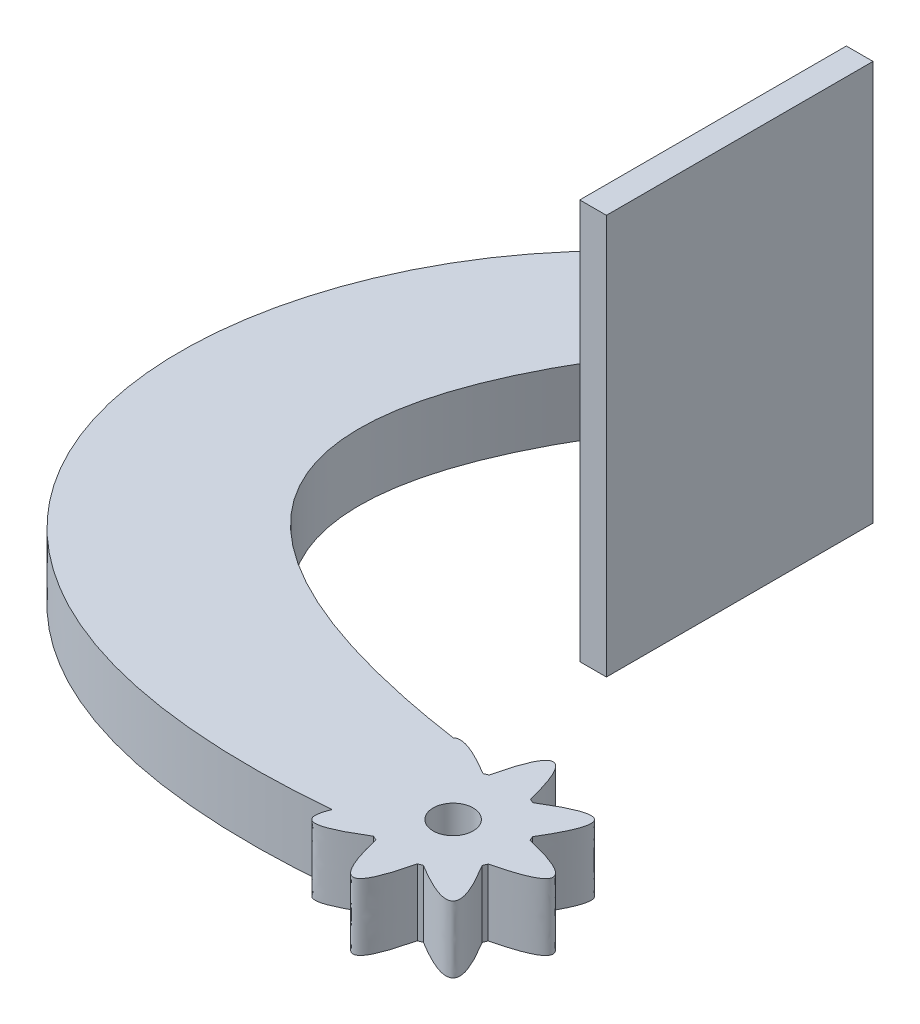
ISO-10303-21;
HEADER;
FILE_DESCRIPTION(('STEP AP214'),'2;1');
FILE_NAME('part.step','',(''),(''),'','','');
FILE_SCHEMA(('AUTOMOTIVE_DESIGN { 1 0 10303 214 1 1 1 1 }'));
ENDSEC;
DATA;
#1=APPLICATION_CONTEXT('core data for automotive mechanical design processes');
#2=APPLICATION_PROTOCOL_DEFINITION('international standard','automotive_design',2000,#1);
#3=PRODUCT_CONTEXT('',#1,'mechanical');
#4=PRODUCT('Part','Part','',(#3));
#5=PRODUCT_RELATED_PRODUCT_CATEGORY('part','',(#4));
#6=PRODUCT_DEFINITION_FORMATION('','',#4);
#7=PRODUCT_DEFINITION_CONTEXT('part definition',#1,'design');
#8=PRODUCT_DEFINITION('design','',#6,#7);
#9=PRODUCT_DEFINITION_SHAPE('','',#8);
#10=(LENGTH_UNIT() NAMED_UNIT(*) SI_UNIT(.MILLI.,.METRE.));
#11=(NAMED_UNIT(*) PLANE_ANGLE_UNIT() SI_UNIT($,.RADIAN.));
#12=(NAMED_UNIT(*) SI_UNIT($,.STERADIAN.) SOLID_ANGLE_UNIT());
#13=UNCERTAINTY_MEASURE_WITH_UNIT(LENGTH_MEASURE(1.E-05),#10,'distance_accuracy_value','');
#14=(GEOMETRIC_REPRESENTATION_CONTEXT(3) GLOBAL_UNCERTAINTY_ASSIGNED_CONTEXT((#13)) GLOBAL_UNIT_ASSIGNED_CONTEXT((#10,
#11,#12)) REPRESENTATION_CONTEXT('',''));
#15=CARTESIAN_POINT('',(0.,0.,0.));
#16=DIRECTION('',(0.,0.,1.));
#17=DIRECTION('',(1.,0.,0.));
#18=AXIS2_PLACEMENT_3D('',#15,#16,#17);
#19=CARTESIAN_POINT('',(-6.,2.5,42.5));
#20=DIRECTION('',(0.,-1.,0.));
#21=DIRECTION('',(0.,0.,-1.));
#22=AXIS2_PLACEMENT_3D('',#19,#20,#21);
#23=CYLINDRICAL_SURFACE('',#22,4.5);
#24=CARTESIAN_POINT('',(-6.,2.5,42.5));
#25=DIRECTION('',(0.,1.,0.));
#26=DIRECTION('',(0.,0.,1.));
#27=AXIS2_PLACEMENT_3D('',#24,#25,#26);
#28=CIRCLE('',#27,4.5);
#29=CARTESIAN_POINT('',(-7.90144374892193,2.5,46.5785428365638));
#30=VERTEX_POINT('',#29);
#31=CARTESIAN_POINT('',(-7.58091960966795,2.5,46.7131571520378));
#32=VERTEX_POINT('',#31);
#33=EDGE_CURVE('E43',#30,#32,#28,.T.);
#34=ORIENTED_EDGE('',*,*,#33,.F.);
#35=DIRECTION('',(0.,-1.,0.));
#36=VECTOR('',#35,1.);
#37=CARTESIAN_POINT('',(-7.90144374892191,2.5,46.5785428365638));
#38=LINE('',#37,#36);
#39=CARTESIAN_POINT('',(-7.90144374892191,-2.5,46.5785428365638));
#40=VERTEX_POINT('',#39);
#41=EDGE_CURVE('E261',#30,#40,#38,.T.);
#42=ORIENTED_EDGE('',*,*,#41,.T.);
#43=CARTESIAN_POINT('',(-6.,-2.5,42.5));
#44=DIRECTION('',(0.,1.,0.));
#45=DIRECTION('',(0.,0.,1.));
#46=AXIS2_PLACEMENT_3D('',#43,#44,#45);
#47=CIRCLE('',#46,4.5);
#48=CARTESIAN_POINT('',(-7.58091960966795,-2.5,46.7131571520378));
#49=VERTEX_POINT('',#48);
#50=EDGE_CURVE('E413',#40,#49,#47,.T.);
#51=ORIENTED_EDGE('',*,*,#50,.T.);
#52=DIRECTION('',(0.,-1.,0.));
#53=VECTOR('',#52,1.);
#54=CARTESIAN_POINT('',(-7.58091960966793,2.5,46.7131571520378));
#55=LINE('',#54,#53);
#56=EDGE_CURVE('E397',#32,#49,#55,.T.);
#57=ORIENTED_EDGE('',*,*,#56,.F.);
#58=EDGE_LOOP('',(#34,#42,#51,#57));
#59=FACE_BOUND('',#58,.T.);
#60=ADVANCED_FACE('F33',(#59),#23,.T.);
#61=CARTESIAN_POINT('',(-7.53944152818656,-2.5,38.2715109339985));
#62=VERTEX_POINT('',#61);
#63=CARTESIAN_POINT('',(-7.86127301590357,-2.5,38.4029690310825));
#64=VERTEX_POINT('',#63);
#65=EDGE_CURVE('E453',#62,#64,#47,.T.);
#66=ORIENTED_EDGE('',*,*,#65,.T.);
#67=DIRECTION('',(0.,-1.,0.));
#68=VECTOR('',#67,1.);
#69=CARTESIAN_POINT('',(-7.86127301590359,2.5,38.4029690310825));
#70=LINE('',#69,#68);
#71=CARTESIAN_POINT('',(-7.86127301590357,2.5,38.4029690310825));
#72=VERTEX_POINT('',#71);
#73=EDGE_CURVE('E281',#72,#64,#70,.T.);
#74=ORIENTED_EDGE('',*,*,#73,.F.);
#75=CARTESIAN_POINT('',(-7.53944152818656,2.5,38.2715109339985));
#76=VERTEX_POINT('',#75);
#77=EDGE_CURVE('E427',#76,#72,#28,.T.);
#78=ORIENTED_EDGE('',*,*,#77,.F.);
#79=DIRECTION('',(0.,-1.,0.));
#80=VECTOR('',#79,1.);
#81=CARTESIAN_POINT('',(-7.53944152818656,2.5,38.2715109339985));
#82=LINE('',#81,#80);
#83=EDGE_CURVE('E334',#76,#62,#82,.T.);
#84=ORIENTED_EDGE('',*,*,#83,.T.);
#85=EDGE_LOOP('',(#66,#74,#78,#84));
#86=FACE_BOUND('',#85,.T.);
#87=ADVANCED_FACE('F459',(#86),#23,.T.);
#88=CARTESIAN_POINT('',(-4.09855625107805,-2.5,38.4214571634362));
#89=VERTEX_POINT('',#88);
#90=CARTESIAN_POINT('',(-4.41908039033205,-2.5,38.2868428479622));
#91=VERTEX_POINT('',#90);
#92=EDGE_CURVE('E449',#89,#91,#47,.T.);
#93=ORIENTED_EDGE('',*,*,#92,.T.);
#94=DIRECTION('',(0.,-1.,0.));
#95=VECTOR('',#94,1.);
#96=CARTESIAN_POINT('',(-4.41908039033207,2.5,38.2868428479622));
#97=LINE('',#96,#95);
#98=CARTESIAN_POINT('',(-4.41908039033205,2.5,38.2868428479622));
#99=VERTEX_POINT('',#98);
#100=EDGE_CURVE('E299',#99,#91,#97,.T.);
#101=ORIENTED_EDGE('',*,*,#100,.F.);
#102=CARTESIAN_POINT('',(-4.09855625107803,2.5,38.4214571634362));
#103=VERTEX_POINT('',#102);
#104=EDGE_CURVE('E429',#103,#99,#28,.T.);
#105=ORIENTED_EDGE('',*,*,#104,.F.);
#106=DIRECTION('',(0.,-1.,0.));
#107=VECTOR('',#106,1.);
#108=CARTESIAN_POINT('',(-4.09855625107805,2.5,38.4214571634362));
#109=LINE('',#108,#107);
#110=EDGE_CURVE('E335',#103,#89,#109,.T.);
#111=ORIENTED_EDGE('',*,*,#110,.T.);
#112=EDGE_LOOP('',(#93,#101,#105,#111));
#113=FACE_BOUND('',#112,.T.);
#114=ADVANCED_FACE('F454',(#113),#23,.T.);
#115=CARTESIAN_POINT('',(-1.77151093399846,-2.5,40.9605584718134));
#116=VERTEX_POINT('',#115);
#117=CARTESIAN_POINT('',(-1.90296903108249,-2.5,40.6387269840964));
#118=VERTEX_POINT('',#117);
#119=EDGE_CURVE('E445',#116,#118,#47,.T.);
#120=ORIENTED_EDGE('',*,*,#119,.T.);
#121=DIRECTION('',(0.,-1.,0.));
#122=VECTOR('',#121,1.);
#123=CARTESIAN_POINT('',(-1.90296903108248,2.5,40.6387269840964));
#124=LINE('',#123,#122);
#125=CARTESIAN_POINT('',(-1.90296903108249,2.5,40.6387269840964));
#126=VERTEX_POINT('',#125);
#127=EDGE_CURVE('E325',#126,#118,#124,.T.);
#128=ORIENTED_EDGE('',*,*,#127,.F.);
#129=CARTESIAN_POINT('',(-1.77151093399846,2.5,40.9605584718134));
#130=VERTEX_POINT('',#129);
#131=EDGE_CURVE('E432',#130,#126,#28,.T.);
#132=ORIENTED_EDGE('',*,*,#131,.F.);
#133=DIRECTION('',(0.,-1.,0.));
#134=VECTOR('',#133,1.);
#135=CARTESIAN_POINT('',(-1.77151093399846,2.5,40.9605584718134));
#136=LINE('',#135,#134);
#137=EDGE_CURVE('E357',#130,#116,#136,.T.);
#138=ORIENTED_EDGE('',*,*,#137,.T.);
#139=EDGE_LOOP('',(#120,#128,#132,#138));
#140=FACE_BOUND('',#139,.T.);
#141=ADVANCED_FACE('F444',(#140),#23,.T.);
#142=CARTESIAN_POINT('',(-1.92145716343623,-2.5,44.401443748922));
#143=VERTEX_POINT('',#142);
#144=CARTESIAN_POINT('',(-1.78684284796218,-2.5,44.0809196096679));
#145=VERTEX_POINT('',#144);
#146=EDGE_CURVE('E423',#143,#145,#47,.T.);
#147=ORIENTED_EDGE('',*,*,#146,.T.);
#148=DIRECTION('',(0.,-1.,0.));
#149=VECTOR('',#148,1.);
#150=CARTESIAN_POINT('',(-1.78684284796218,2.5,44.0809196096679));
#151=LINE('',#150,#149);
#152=CARTESIAN_POINT('',(-1.78684284796218,2.5,44.0809196096679));
#153=VERTEX_POINT('',#152);
#154=EDGE_CURVE('E349',#153,#145,#151,.T.);
#155=ORIENTED_EDGE('',*,*,#154,.F.);
#156=CARTESIAN_POINT('',(-1.92145716343624,2.5,44.401443748922));
#157=VERTEX_POINT('',#156);
#158=EDGE_CURVE('E42',#157,#153,#28,.T.);
#159=ORIENTED_EDGE('',*,*,#158,.F.);
#160=DIRECTION('',(0.,-1.,0.));
#161=VECTOR('',#160,1.);
#162=CARTESIAN_POINT('',(-1.92145716343623,2.5,44.401443748922));
#163=LINE('',#162,#161);
#164=EDGE_CURVE('E406',#157,#143,#163,.T.);
#165=ORIENTED_EDGE('',*,*,#164,.T.);
#166=EDGE_LOOP('',(#147,#155,#159,#165));
#167=FACE_BOUND('',#166,.T.);
#168=ADVANCED_FACE('F504',(#167),#23,.T.);
#169=CARTESIAN_POINT('',(-4.46055847181344,-2.5,46.7284890660016));
#170=VERTEX_POINT('',#169);
#171=CARTESIAN_POINT('',(-4.13872698409646,-2.5,46.5970309689175));
#172=VERTEX_POINT('',#171);
#173=EDGE_CURVE('E37',#170,#172,#47,.T.);
#174=ORIENTED_EDGE('',*,*,#173,.T.);
#175=DIRECTION('',(0.,-1.,0.));
#176=VECTOR('',#175,1.);
#177=CARTESIAN_POINT('',(-4.13872698409645,2.5,46.5970309689175));
#178=LINE('',#177,#176);
#179=CARTESIAN_POINT('',(-4.13872698409646,2.5,46.5970309689175));
#180=VERTEX_POINT('',#179);
#181=EDGE_CURVE('E372',#180,#172,#178,.T.);
#182=ORIENTED_EDGE('',*,*,#181,.F.);
#183=CARTESIAN_POINT('',(-4.46055847181344,2.5,46.7284890660016));
#184=VERTEX_POINT('',#183);
#185=EDGE_CURVE('E11',#184,#180,#28,.T.);
#186=ORIENTED_EDGE('',*,*,#185,.F.);
#187=DIRECTION('',(0.,-1.,0.));
#188=VECTOR('',#187,1.);
#189=CARTESIAN_POINT('',(-4.46055847181344,2.5,46.7284890660016));
#190=LINE('',#189,#188);
#191=EDGE_CURVE('E407',#184,#170,#190,.T.);
#192=ORIENTED_EDGE('',*,*,#191,.T.);
#193=EDGE_LOOP('',(#174,#182,#186,#192));
#194=FACE_BOUND('',#193,.T.);
#195=ADVANCED_FACE('F35',(#194),#23,.T.);
#196=CARTESIAN_POINT('',(-6.,2.5,42.5));
#197=DIRECTION('',(0.,1.,0.));
#198=DIRECTION('',(0.,0.,1.));
#199=AXIS2_PLACEMENT_3D('',#196,#197,#198);
#200=PLANE('',#199);
#201=CARTESIAN_POINT('',(-6.,2.5,42.5));
#202=DIRECTION('',(0.,-1.,0.));
#203=DIRECTION('',(0.,0.,-1.));
#204=AXIS2_PLACEMENT_3D('',#201,#202,#203);
#205=CIRCLE('',#204,1.5);
#206=CARTESIAN_POINT('',(-6.,2.5,41.));
#207=VERTEX_POINT('',#206);
#208=EDGE_CURVE('E272',#207,#207,#205,.T.);
#209=ORIENTED_EDGE('',*,*,#208,.T.);
#210=EDGE_LOOP('',(#209));
#211=FACE_BOUND('',#210,.T.);
#212=CARTESIAN_POINT('',(-29.,2.5,-5.97606414611491));
#213=CARTESIAN_POINT('',(-52.9692352131108,2.5,5.1649572458112));
#214=CARTESIAN_POINT('',(-57.3390164293783,2.5,50.619962253794));
#215=CARTESIAN_POINT('',(-11.1788103015137,2.5,46.3980335687222));
#216=B_SPLINE_CURVE_WITH_KNOTS('',3,(#212,#213,#214,#215),.UNSPECIFIED.,.F.,.F.,(4,4),(0.,1.),.UNSPECIFIED.);
#217=CARTESIAN_POINT('',(-29.,2.5,-5.97606414611491));
#218=VERTEX_POINT('',#217);
#219=CARTESIAN_POINT('',(-11.1788103014872,2.5,46.3980335687365));
#220=VERTEX_POINT('',#219);
#221=EDGE_CURVE('E225',#218,#220,#216,.T.);
#222=ORIENTED_EDGE('',*,*,#221,.T.);
#223=CARTESIAN_POINT('',(-7.9014437489219,2.5,46.5785428365638));
#224=CARTESIAN_POINT('',(-13.6170244948079,2.5,50.1271154226686));
#225=CARTESIAN_POINT('',(-10.0970309689175,2.5,44.3612730159036));
#226=B_SPLINE_CURVE_WITH_KNOTS('',2,(#223,#224,#225),.UNSPECIFIED.,.F.,.F.,(3,3),(0.,1.),.UNSPECIFIED.);
#227=EDGE_CURVE('E254',#30,#220,#226,.T.);
#228=ORIENTED_EDGE('',*,*,#227,.F.);
#229=ORIENTED_EDGE('',*,*,#33,.T.);
#230=CARTESIAN_POINT('',(-4.46055847181344,2.5,46.7284890660015));
#231=CARTESIAN_POINT('',(-5.99286463648132,2.5,53.2792347090042));
#232=CARTESIAN_POINT('',(-7.58091960966794,2.5,46.7131571520378));
#233=B_SPLINE_CURVE_WITH_KNOTS('',2,(#230,#231,#232),.UNSPECIFIED.,.F.,.F.,(3,3),(0.,1.),.UNSPECIFIED.);
#234=EDGE_CURVE('E390',#184,#32,#233,.T.);
#235=ORIENTED_EDGE('',*,*,#234,.F.);
#236=ORIENTED_EDGE('',*,*,#185,.T.);
#237=CARTESIAN_POINT('',(-1.92145716343625,2.5,44.4014437489219));
#238=CARTESIAN_POINT('',(1.62711542266855,2.5,50.117024494808));
#239=CARTESIAN_POINT('',(-4.13872698409645,2.5,46.5970309689175));
#240=B_SPLINE_CURVE_WITH_KNOTS('',2,(#237,#238,#239),.UNSPECIFIED.,.F.,.F.,(3,3),(0.,1.),.UNSPECIFIED.);
#241=EDGE_CURVE('E366',#157,#180,#240,.T.);
#242=ORIENTED_EDGE('',*,*,#241,.F.);
#243=ORIENTED_EDGE('',*,*,#158,.T.);
#244=CARTESIAN_POINT('',(-1.77151093399847,2.5,40.9605584718134));
#245=CARTESIAN_POINT('',(4.77923470900418,2.5,42.4928646364813));
#246=CARTESIAN_POINT('',(-1.78684284796218,2.5,44.0809196096679));
#247=B_SPLINE_CURVE_WITH_KNOTS('',2,(#244,#245,#246),.UNSPECIFIED.,.F.,.F.,(3,3),(0.,1.),.UNSPECIFIED.);
#248=EDGE_CURVE('E343',#130,#153,#247,.T.);
#249=ORIENTED_EDGE('',*,*,#248,.F.);
#250=ORIENTED_EDGE('',*,*,#131,.T.);
#251=CARTESIAN_POINT('',(-4.09855625107806,2.5,38.4214571634362));
#252=CARTESIAN_POINT('',(1.61702449480793,2.5,34.8728845773314));
#253=CARTESIAN_POINT('',(-1.90296903108248,2.5,40.6387269840964));
#254=B_SPLINE_CURVE_WITH_KNOTS('',2,(#251,#252,#253),.UNSPECIFIED.,.F.,.F.,(3,3),(0.,1.),.UNSPECIFIED.);
#255=EDGE_CURVE('E318',#103,#126,#254,.T.);
#256=ORIENTED_EDGE('',*,*,#255,.F.);
#257=ORIENTED_EDGE('',*,*,#104,.T.);
#258=CARTESIAN_POINT('',(-7.53944152818656,2.5,38.2715109339985));
#259=CARTESIAN_POINT('',(-6.00713536351868,2.5,31.7207652909958));
#260=CARTESIAN_POINT('',(-4.41908039033206,2.5,38.2868428479622));
#261=B_SPLINE_CURVE_WITH_KNOTS('',2,(#258,#259,#260),.UNSPECIFIED.,.F.,.F.,(3,3),(0.,1.),.UNSPECIFIED.);
#262=EDGE_CURVE('E293',#76,#99,#261,.T.);
#263=ORIENTED_EDGE('',*,*,#262,.F.);
#264=ORIENTED_EDGE('',*,*,#77,.T.);
#265=CARTESIAN_POINT('',(-10.0785428365638,2.5,40.5985562510781));
#266=CARTESIAN_POINT('',(-13.6271154226686,2.5,34.8829755051921));
#267=CARTESIAN_POINT('',(-7.86127301590359,2.5,38.4029690310825));
#268=B_SPLINE_CURVE_WITH_KNOTS('',2,(#265,#266,#267),.UNSPECIFIED.,.F.,.F.,(3,3),(0.,1.),.UNSPECIFIED.);
#269=CARTESIAN_POINT('',(-11.3009173322139,2.5,37.1942731352347));
#270=VERTEX_POINT('',#269);
#271=EDGE_CURVE('E57',#270,#72,#268,.T.);
#272=ORIENTED_EDGE('',*,*,#271,.F.);
#273=CARTESIAN_POINT('',(-29.,2.5,5.11073290780489));
#274=CARTESIAN_POINT('',(-46.7471306554618,2.5,31.9729437511123));
#275=CARTESIAN_POINT('',(-11.3009173322139,2.5,37.1942731352347));
#276=B_SPLINE_CURVE_WITH_KNOTS('',2,(#273,#274,#275),.UNSPECIFIED.,.F.,.F.,(3,3),(0.,1.),.UNSPECIFIED.);
#277=CARTESIAN_POINT('',(-29.,2.5,5.11073290780489));
#278=VERTEX_POINT('',#277);
#279=EDGE_CURVE('E219',#278,#270,#276,.T.);
#280=ORIENTED_EDGE('',*,*,#279,.F.);
#281=DIRECTION('',(0.,0.,1.));
#282=VECTOR('',#281,1.);
#283=CARTESIAN_POINT('',(-29.,2.5,-5.97606414611491));
#284=LINE('',#283,#282);
#285=EDGE_CURVE('E216',#218,#278,#284,.T.);
#286=ORIENTED_EDGE('',*,*,#285,.F.);
#287=EDGE_LOOP('',(#222,#228,#229,#235,#236,#242,#243,#249,#250,#256,#257,#263,#264,#272,#280,#286));
#288=FACE_BOUND('',#287,.T.);
#289=ADVANCED_FACE('F389',(#211,#288),#200,.T.);
#290=CARTESIAN_POINT('',(-6.,-2.5,42.5));
#291=DIRECTION('',(0.,1.,0.));
#292=DIRECTION('',(0.,0.,1.));
#293=AXIS2_PLACEMENT_3D('',#290,#291,#292);
#294=PLANE('',#293);
#295=CARTESIAN_POINT('',(-6.,-2.5,42.5));
#296=DIRECTION('',(0.,-1.,0.));
#297=DIRECTION('',(0.,0.,-1.));
#298=AXIS2_PLACEMENT_3D('',#295,#296,#297);
#299=CIRCLE('',#298,1.5);
#300=CARTESIAN_POINT('',(-6.,-2.5,41.));
#301=VERTEX_POINT('',#300);
#302=EDGE_CURVE('E263',#301,#301,#299,.T.);
#303=ORIENTED_EDGE('',*,*,#302,.F.);
#304=EDGE_LOOP('',(#303));
#305=FACE_BOUND('',#304,.T.);
#306=CARTESIAN_POINT('',(-7.9014437489219,-2.5,46.5785428365638));
#307=CARTESIAN_POINT('',(-13.6170244948079,-2.5,50.1271154226686));
#308=CARTESIAN_POINT('',(-10.0970309689175,-2.5,44.3612730159036));
#309=B_SPLINE_CURVE_WITH_KNOTS('',2,(#306,#307,#308),.UNSPECIFIED.,.F.,.F.,(3,3),(0.,1.),.UNSPECIFIED.);
#310=CARTESIAN_POINT('',(-11.1788103014872,-2.5,46.3980335687365));
#311=VERTEX_POINT('',#310);
#312=EDGE_CURVE('E262',#40,#311,#309,.T.);
#313=ORIENTED_EDGE('',*,*,#312,.T.);
#314=CARTESIAN_POINT('',(-29.,-2.5,-5.97606414611491));
#315=CARTESIAN_POINT('',(-52.9692352131108,-2.5,5.1649572458112));
#316=CARTESIAN_POINT('',(-57.3390164293783,-2.5,50.619962253794));
#317=CARTESIAN_POINT('',(-11.1788103015137,-2.5,46.3980335687222));
#318=B_SPLINE_CURVE_WITH_KNOTS('',3,(#314,#315,#316,#317),.UNSPECIFIED.,.F.,.F.,(4,4),(0.,1.),.UNSPECIFIED.);
#319=CARTESIAN_POINT('',(-29.,-2.5,-5.97606414611491));
#320=VERTEX_POINT('',#319);
#321=EDGE_CURVE('E220',#320,#311,#318,.T.);
#322=ORIENTED_EDGE('',*,*,#321,.F.);
#323=DIRECTION('',(0.,0.,1.));
#324=VECTOR('',#323,1.);
#325=CARTESIAN_POINT('',(-29.,-2.5,-5.97606414611491));
#326=LINE('',#325,#324);
#327=CARTESIAN_POINT('',(-29.,-2.5,5.11073290780489));
#328=VERTEX_POINT('',#327);
#329=EDGE_CURVE('E211',#320,#328,#326,.T.);
#330=ORIENTED_EDGE('',*,*,#329,.T.);
#331=CARTESIAN_POINT('',(-29.,-2.5,5.11073290780489));
#332=CARTESIAN_POINT('',(-46.7471306554618,-2.5,31.9729437511123));
#333=CARTESIAN_POINT('',(-11.3009173322139,-2.5,37.1942731352347));
#334=B_SPLINE_CURVE_WITH_KNOTS('',2,(#331,#332,#333),.UNSPECIFIED.,.F.,.F.,(3,3),(0.,1.),.UNSPECIFIED.);
#335=CARTESIAN_POINT('',(-11.3009173322139,-2.5,37.1942731352347));
#336=VERTEX_POINT('',#335);
#337=EDGE_CURVE('E464',#328,#336,#334,.T.);
#338=ORIENTED_EDGE('',*,*,#337,.T.);
#339=CARTESIAN_POINT('',(-10.0785428365638,-2.5,40.5985562510781));
#340=CARTESIAN_POINT('',(-13.6271154226686,-2.5,34.8829755051921));
#341=CARTESIAN_POINT('',(-7.86127301590359,-2.5,38.4029690310825));
#342=B_SPLINE_CURVE_WITH_KNOTS('',2,(#339,#340,#341),.UNSPECIFIED.,.F.,.F.,(3,3),(0.,1.),.UNSPECIFIED.);
#343=EDGE_CURVE('E276',#336,#64,#342,.T.);
#344=ORIENTED_EDGE('',*,*,#343,.T.);
#345=ORIENTED_EDGE('',*,*,#65,.F.);
#346=CARTESIAN_POINT('',(-7.53944152818656,-2.5,38.2715109339985));
#347=CARTESIAN_POINT('',(-6.00713536351868,-2.5,31.7207652909958));
#348=CARTESIAN_POINT('',(-4.41908039033206,-2.5,38.2868428479622));
#349=B_SPLINE_CURVE_WITH_KNOTS('',2,(#346,#347,#348),.UNSPECIFIED.,.F.,.F.,(3,3),(0.,1.),.UNSPECIFIED.);
#350=EDGE_CURVE('E292',#62,#91,#349,.T.);
#351=ORIENTED_EDGE('',*,*,#350,.T.);
#352=ORIENTED_EDGE('',*,*,#92,.F.);
#353=CARTESIAN_POINT('',(-4.09855625107806,-2.5,38.4214571634362));
#354=CARTESIAN_POINT('',(1.61702449480793,-2.5,34.8728845773314));
#355=CARTESIAN_POINT('',(-1.90296903108248,-2.5,40.6387269840964));
#356=B_SPLINE_CURVE_WITH_KNOTS('',2,(#353,#354,#355),.UNSPECIFIED.,.F.,.F.,(3,3),(0.,1.),.UNSPECIFIED.);
#357=EDGE_CURVE('E326',#89,#118,#356,.T.);
#358=ORIENTED_EDGE('',*,*,#357,.T.);
#359=ORIENTED_EDGE('',*,*,#119,.F.);
#360=CARTESIAN_POINT('',(-1.77151093399847,-2.5,40.9605584718134));
#361=CARTESIAN_POINT('',(4.77923470900418,-2.5,42.4928646364813));
#362=CARTESIAN_POINT('',(-1.78684284796218,-2.5,44.0809196096679));
#363=B_SPLINE_CURVE_WITH_KNOTS('',2,(#360,#361,#362),.UNSPECIFIED.,.F.,.F.,(3,3),(0.,1.),.UNSPECIFIED.);
#364=EDGE_CURVE('E341',#116,#145,#363,.T.);
#365=ORIENTED_EDGE('',*,*,#364,.T.);
#366=ORIENTED_EDGE('',*,*,#146,.F.);
#367=CARTESIAN_POINT('',(-1.92145716343625,-2.5,44.4014437489219));
#368=CARTESIAN_POINT('',(1.62711542266855,-2.5,50.117024494808));
#369=CARTESIAN_POINT('',(-4.13872698409645,-2.5,46.5970309689175));
#370=B_SPLINE_CURVE_WITH_KNOTS('',2,(#367,#368,#369),.UNSPECIFIED.,.F.,.F.,(3,3),(0.,1.),.UNSPECIFIED.);
#371=EDGE_CURVE('E363',#143,#172,#370,.T.);
#372=ORIENTED_EDGE('',*,*,#371,.T.);
#373=ORIENTED_EDGE('',*,*,#173,.F.);
#374=CARTESIAN_POINT('',(-4.46055847181344,-2.5,46.7284890660015));
#375=CARTESIAN_POINT('',(-5.99286463648132,-2.5,53.2792347090042));
#376=CARTESIAN_POINT('',(-7.58091960966794,-2.5,46.7131571520378));
#377=B_SPLINE_CURVE_WITH_KNOTS('',2,(#374,#375,#376),.UNSPECIFIED.,.F.,.F.,(3,3),(0.,1.),.UNSPECIFIED.);
#378=EDGE_CURVE('E398',#170,#49,#377,.T.);
#379=ORIENTED_EDGE('',*,*,#378,.T.);
#380=ORIENTED_EDGE('',*,*,#50,.F.);
#381=EDGE_LOOP('',(#313,#322,#330,#338,#344,#345,#351,#352,#358,#359,#365,#366,#372,#373,#379,#380));
#382=FACE_BOUND('',#381,.T.);
#383=ADVANCED_FACE('F387',(#305,#382),#294,.F.);
#384=DIRECTION('',(0.,-1.,0.));
#385=VECTOR('',#384,1.);
#386=SURFACE_OF_LINEAR_EXTRUSION('',#233,#385);
#387=ORIENTED_EDGE('',*,*,#378,.F.);
#388=ORIENTED_EDGE('',*,*,#191,.F.);
#389=ORIENTED_EDGE('',*,*,#234,.T.);
#390=ORIENTED_EDGE('',*,*,#56,.T.);
#391=EDGE_LOOP('',(#387,#388,#389,#390));
#392=FACE_BOUND('',#391,.T.);
#393=ADVANCED_FACE('F382',(#392),#386,.T.);
#394=DIRECTION('',(0.,-1.,0.));
#395=VECTOR('',#394,1.);
#396=SURFACE_OF_LINEAR_EXTRUSION('',#240,#395);
#397=ORIENTED_EDGE('',*,*,#371,.F.);
#398=ORIENTED_EDGE('',*,*,#164,.F.);
#399=ORIENTED_EDGE('',*,*,#241,.T.);
#400=ORIENTED_EDGE('',*,*,#181,.T.);
#401=EDGE_LOOP('',(#397,#398,#399,#400));
#402=FACE_BOUND('',#401,.T.);
#403=ADVANCED_FACE('F379',(#402),#396,.T.);
#404=DIRECTION('',(0.,-1.,0.));
#405=VECTOR('',#404,1.);
#406=SURFACE_OF_LINEAR_EXTRUSION('',#247,#405);
#407=ORIENTED_EDGE('',*,*,#364,.F.);
#408=ORIENTED_EDGE('',*,*,#137,.F.);
#409=ORIENTED_EDGE('',*,*,#248,.T.);
#410=ORIENTED_EDGE('',*,*,#154,.T.);
#411=EDGE_LOOP('',(#407,#408,#409,#410));
#412=FACE_BOUND('',#411,.T.);
#413=ADVANCED_FACE('F314',(#412),#406,.T.);
#414=DIRECTION('',(0.,-1.,0.));
#415=VECTOR('',#414,1.);
#416=SURFACE_OF_LINEAR_EXTRUSION('',#254,#415);
#417=ORIENTED_EDGE('',*,*,#357,.F.);
#418=ORIENTED_EDGE('',*,*,#110,.F.);
#419=ORIENTED_EDGE('',*,*,#255,.T.);
#420=ORIENTED_EDGE('',*,*,#127,.T.);
#421=EDGE_LOOP('',(#417,#418,#419,#420));
#422=FACE_BOUND('',#421,.T.);
#423=ADVANCED_FACE('F309',(#422),#416,.T.);
#424=DIRECTION('',(0.,-1.,0.));
#425=VECTOR('',#424,1.);
#426=SURFACE_OF_LINEAR_EXTRUSION('',#261,#425);
#427=ORIENTED_EDGE('',*,*,#350,.F.);
#428=ORIENTED_EDGE('',*,*,#83,.F.);
#429=ORIENTED_EDGE('',*,*,#262,.T.);
#430=ORIENTED_EDGE('',*,*,#100,.T.);
#431=EDGE_LOOP('',(#427,#428,#429,#430));
#432=FACE_BOUND('',#431,.T.);
#433=ADVANCED_FACE('F306',(#432),#426,.T.);
#434=DIRECTION('',(0.,-1.,0.));
#435=VECTOR('',#434,1.);
#436=SURFACE_OF_LINEAR_EXTRUSION('',#268,#435);
#437=DIRECTION('',(0.,-1.,0.));
#438=VECTOR('',#437,1.);
#439=CARTESIAN_POINT('',(-11.3009173322139,2.5,37.1942731352347));
#440=LINE('',#439,#438);
#441=EDGE_CURVE('E461',#270,#336,#440,.T.);
#442=ORIENTED_EDGE('',*,*,#441,.F.);
#443=ORIENTED_EDGE('',*,*,#271,.T.);
#444=ORIENTED_EDGE('',*,*,#73,.T.);
#445=ORIENTED_EDGE('',*,*,#343,.F.);
#446=EDGE_LOOP('',(#442,#443,#444,#445));
#447=FACE_BOUND('',#446,.T.);
#448=ADVANCED_FACE('F250',(#447),#436,.T.);
#449=DIRECTION('',(0.,-1.,0.));
#450=VECTOR('',#449,1.);
#451=SURFACE_OF_LINEAR_EXTRUSION('',#226,#450);
#452=DIRECTION('',(0.,-1.,0.));
#453=VECTOR('',#452,1.);
#454=CARTESIAN_POINT('',(-11.1788103014872,2.5,46.3980335687365));
#455=LINE('',#454,#453);
#456=EDGE_CURVE('E483',#220,#311,#455,.T.);
#457=ORIENTED_EDGE('',*,*,#456,.T.);
#458=ORIENTED_EDGE('',*,*,#312,.F.);
#459=ORIENTED_EDGE('',*,*,#41,.F.);
#460=ORIENTED_EDGE('',*,*,#227,.T.);
#461=EDGE_LOOP('',(#457,#458,#459,#460));
#462=FACE_BOUND('',#461,.T.);
#463=ADVANCED_FACE('F245',(#462),#451,.T.);
#464=CARTESIAN_POINT('',(-6.,2.5,42.5));
#465=DIRECTION('',(0.,-1.,0.));
#466=DIRECTION('',(0.,0.,-1.));
#467=AXIS2_PLACEMENT_3D('',#464,#465,#466);
#468=CYLINDRICAL_SURFACE('',#467,1.5);
#469=ORIENTED_EDGE('',*,*,#302,.T.);
#470=EDGE_LOOP('',(#469));
#471=FACE_BOUND('',#470,.T.);
#472=ORIENTED_EDGE('',*,*,#208,.F.);
#473=EDGE_LOOP('',(#472));
#474=FACE_BOUND('',#473,.T.);
#475=ADVANCED_FACE('F242',(#471,#474),#468,.F.);
#476=DIRECTION('',(0.,-1.,0.));
#477=VECTOR('',#476,1.);
#478=SURFACE_OF_LINEAR_EXTRUSION('',#216,#477);
#479=ORIENTED_EDGE('',*,*,#321,.T.);
#480=ORIENTED_EDGE('',*,*,#456,.F.);
#481=ORIENTED_EDGE('',*,*,#221,.F.);
#482=DIRECTION('',(0.,-1.,0.));
#483=VECTOR('',#482,1.);
#484=CARTESIAN_POINT('',(-29.,2.5,-5.97606414611491));
#485=LINE('',#484,#483);
#486=EDGE_CURVE('E478',#218,#320,#485,.T.);
#487=ORIENTED_EDGE('',*,*,#486,.T.);
#488=EDGE_LOOP('',(#479,#480,#481,#487));
#489=FACE_BOUND('',#488,.T.);
#490=ADVANCED_FACE('F239',(#489),#478,.F.);
#491=DIRECTION('',(0.,-1.,0.));
#492=VECTOR('',#491,1.);
#493=SURFACE_OF_LINEAR_EXTRUSION('',#276,#492);
#494=ORIENTED_EDGE('',*,*,#337,.F.);
#495=DIRECTION('',(0.,-1.,0.));
#496=VECTOR('',#495,1.);
#497=CARTESIAN_POINT('',(-29.,2.5,5.11073290780489));
#498=LINE('',#497,#496);
#499=EDGE_CURVE('E487',#278,#328,#498,.T.);
#500=ORIENTED_EDGE('',*,*,#499,.F.);
#501=ORIENTED_EDGE('',*,*,#279,.T.);
#502=ORIENTED_EDGE('',*,*,#441,.T.);
#503=EDGE_LOOP('',(#494,#500,#501,#502));
#504=FACE_BOUND('',#503,.T.);
#505=ADVANCED_FACE('F234',(#504),#493,.T.);
#506=CARTESIAN_POINT('',(-29.,15.,-10.));
#507=DIRECTION('',(1.,0.,0.));
#508=DIRECTION('',(0.,0.,-1.));
#509=AXIS2_PLACEMENT_3D('',#506,#507,#508);
#510=PLANE('',#509);
#511=DIRECTION('',(0.,0.,1.));
#512=VECTOR('',#511,1.);
#513=CARTESIAN_POINT('',(-29.,-15.,-10.));
#514=LINE('',#513,#512);
#515=CARTESIAN_POINT('',(-29.,-15.,-10.));
#516=VERTEX_POINT('',#515);
#517=CARTESIAN_POINT('',(-29.,-15.,10.));
#518=VERTEX_POINT('',#517);
#519=EDGE_CURVE('E198',#516,#518,#514,.T.);
#520=ORIENTED_EDGE('',*,*,#519,.T.);
#521=DIRECTION('',(0.,-1.,0.));
#522=VECTOR('',#521,1.);
#523=CARTESIAN_POINT('',(-29.,15.,10.));
#524=LINE('',#523,#522);
#525=CARTESIAN_POINT('',(-29.,15.,10.));
#526=VERTEX_POINT('',#525);
#527=EDGE_CURVE('E212',#526,#518,#524,.T.);
#528=ORIENTED_EDGE('',*,*,#527,.F.);
#529=DIRECTION('',(0.,0.,1.));
#530=VECTOR('',#529,1.);
#531=CARTESIAN_POINT('',(-29.,15.,-10.));
#532=LINE('',#531,#530);
#533=CARTESIAN_POINT('',(-29.,15.,-10.));
#534=VERTEX_POINT('',#533);
#535=EDGE_CURVE('E185',#534,#526,#532,.T.);
#536=ORIENTED_EDGE('',*,*,#535,.F.);
#537=DIRECTION('',(0.,-1.,0.));
#538=VECTOR('',#537,1.);
#539=CARTESIAN_POINT('',(-29.,15.,-10.));
#540=LINE('',#539,#538);
#541=EDGE_CURVE('E196',#534,#516,#540,.T.);
#542=ORIENTED_EDGE('',*,*,#541,.T.);
#543=EDGE_LOOP('',(#520,#528,#536,#542));
#544=FACE_BOUND('',#543,.T.);
#545=ORIENTED_EDGE('',*,*,#329,.F.);
#546=ORIENTED_EDGE('',*,*,#486,.F.);
#547=ORIENTED_EDGE('',*,*,#285,.T.);
#548=ORIENTED_EDGE('',*,*,#499,.T.);
#549=EDGE_LOOP('',(#545,#546,#547,#548));
#550=FACE_BOUND('',#549,.T.);
#551=ADVANCED_FACE('F238',(#544,#550),#510,.F.);
#552=CARTESIAN_POINT('',(-29.,15.,-10.));
#553=DIRECTION('',(0.,0.,-1.));
#554=DIRECTION('',(-1.,0.,0.));
#555=AXIS2_PLACEMENT_3D('',#552,#553,#554);
#556=PLANE('',#555);
#557=DIRECTION('',(1.,0.,0.));
#558=VECTOR('',#557,1.);
#559=CARTESIAN_POINT('',(-29.,-15.,-10.));
#560=LINE('',#559,#558);
#561=CARTESIAN_POINT('',(-27.,-15.,-10.));
#562=VERTEX_POINT('',#561);
#563=EDGE_CURVE('E205',#516,#562,#560,.T.);
#564=ORIENTED_EDGE('',*,*,#563,.F.);
#565=ORIENTED_EDGE('',*,*,#541,.F.);
#566=DIRECTION('',(1.,0.,0.));
#567=VECTOR('',#566,1.);
#568=CARTESIAN_POINT('',(-29.,15.,-10.));
#569=LINE('',#568,#567);
#570=CARTESIAN_POINT('',(-27.,15.,-10.));
#571=VERTEX_POINT('',#570);
#572=EDGE_CURVE('E190',#534,#571,#569,.T.);
#573=ORIENTED_EDGE('',*,*,#572,.T.);
#574=DIRECTION('',(0.,-1.,0.));
#575=VECTOR('',#574,1.);
#576=CARTESIAN_POINT('',(-27.,15.,-10.));
#577=LINE('',#576,#575);
#578=EDGE_CURVE('E174',#571,#562,#577,.T.);
#579=ORIENTED_EDGE('',*,*,#578,.T.);
#580=EDGE_LOOP('',(#564,#565,#573,#579));
#581=FACE_BOUND('',#580,.T.);
#582=ADVANCED_FACE('F195',(#581),#556,.T.);
#583=CARTESIAN_POINT('',(-29.,15.,10.));
#584=DIRECTION('',(0.,0.,-1.));
#585=DIRECTION('',(-1.,0.,0.));
#586=AXIS2_PLACEMENT_3D('',#583,#584,#585);
#587=PLANE('',#586);
#588=DIRECTION('',(1.,0.,0.));
#589=VECTOR('',#588,1.);
#590=CARTESIAN_POINT('',(-29.,-15.,10.));
#591=LINE('',#590,#589);
#592=CARTESIAN_POINT('',(-27.,-15.,10.));
#593=VERTEX_POINT('',#592);
#594=EDGE_CURVE('E200',#518,#593,#591,.T.);
#595=ORIENTED_EDGE('',*,*,#594,.T.);
#596=DIRECTION('',(0.,-1.,0.));
#597=VECTOR('',#596,1.);
#598=CARTESIAN_POINT('',(-27.,15.,10.));
#599=LINE('',#598,#597);
#600=CARTESIAN_POINT('',(-27.,15.,10.));
#601=VERTEX_POINT('',#600);
#602=EDGE_CURVE('E184',#601,#593,#599,.T.);
#603=ORIENTED_EDGE('',*,*,#602,.F.);
#604=DIRECTION('',(1.,0.,0.));
#605=VECTOR('',#604,1.);
#606=CARTESIAN_POINT('',(-29.,15.,10.));
#607=LINE('',#606,#605);
#608=EDGE_CURVE('E192',#526,#601,#607,.T.);
#609=ORIENTED_EDGE('',*,*,#608,.F.);
#610=ORIENTED_EDGE('',*,*,#527,.T.);
#611=EDGE_LOOP('',(#595,#603,#609,#610));
#612=FACE_BOUND('',#611,.T.);
#613=ADVANCED_FACE('F589',(#612),#587,.F.);
#614=CARTESIAN_POINT('',(-27.,15.,-10.));
#615=DIRECTION('',(1.,0.,0.));
#616=DIRECTION('',(0.,0.,-1.));
#617=AXIS2_PLACEMENT_3D('',#614,#615,#616);
#618=PLANE('',#617);
#619=DIRECTION('',(0.,0.,1.));
#620=VECTOR('',#619,1.);
#621=CARTESIAN_POINT('',(-27.,-15.,-10.));
#622=LINE('',#621,#620);
#623=EDGE_CURVE('E179',#562,#593,#622,.T.);
#624=ORIENTED_EDGE('',*,*,#623,.F.);
#625=ORIENTED_EDGE('',*,*,#578,.F.);
#626=DIRECTION('',(0.,0.,1.));
#627=VECTOR('',#626,1.);
#628=CARTESIAN_POINT('',(-27.,15.,-10.));
#629=LINE('',#628,#627);
#630=EDGE_CURVE('E177',#571,#601,#629,.T.);
#631=ORIENTED_EDGE('',*,*,#630,.T.);
#632=ORIENTED_EDGE('',*,*,#602,.T.);
#633=EDGE_LOOP('',(#624,#625,#631,#632));
#634=FACE_BOUND('',#633,.T.);
#635=ADVANCED_FACE('F176',(#634),#618,.T.);
#636=CARTESIAN_POINT('',(0.,15.,0.));
#637=DIRECTION('',(0.,-1.,0.));
#638=DIRECTION('',(0.,0.,-1.));
#639=AXIS2_PLACEMENT_3D('',#636,#637,#638);
#640=PLANE('',#639);
#641=ORIENTED_EDGE('',*,*,#572,.F.);
#642=ORIENTED_EDGE('',*,*,#535,.T.);
#643=ORIENTED_EDGE('',*,*,#608,.T.);
#644=ORIENTED_EDGE('',*,*,#630,.F.);
#645=EDGE_LOOP('',(#641,#642,#643,#644));
#646=FACE_BOUND('',#645,.T.);
#647=ADVANCED_FACE('F189',(#646),#640,.F.);
#648=CARTESIAN_POINT('',(0.,-15.,0.));
#649=DIRECTION('',(0.,-1.,0.));
#650=DIRECTION('',(0.,0.,-1.));
#651=AXIS2_PLACEMENT_3D('',#648,#649,#650);
#652=PLANE('',#651);
#653=ORIENTED_EDGE('',*,*,#563,.T.);
#654=ORIENTED_EDGE('',*,*,#623,.T.);
#655=ORIENTED_EDGE('',*,*,#594,.F.);
#656=ORIENTED_EDGE('',*,*,#519,.F.);
#657=EDGE_LOOP('',(#653,#654,#655,#656));
#658=FACE_BOUND('',#657,.T.);
#659=ADVANCED_FACE('F608',(#658),#652,.T.);
#660=CLOSED_SHELL('',(#60,#87,#114,#141,#168,#195,#289,#383,#393,#403,#413,#423,#433,#448,#463,
#475,#490,#505,#551,#582,#613,#635,#647,#659));
#661=MANIFOLD_SOLID_BREP('B2',#660);
#662=ADVANCED_BREP_SHAPE_REPRESENTATION('',(#18,#661),#14);
#663=SHAPE_DEFINITION_REPRESENTATION(#9,#662);
ENDSEC;
END-ISO-10303-21;
